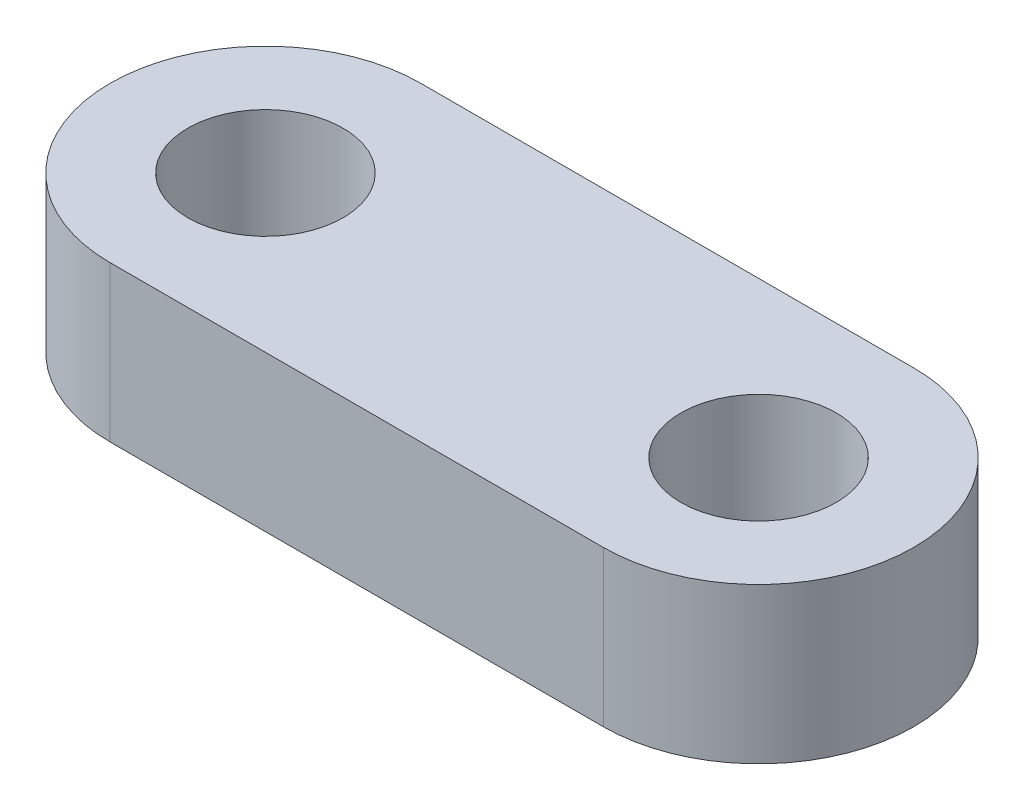
ISO-10303-21;
HEADER;
FILE_DESCRIPTION(('STEP AP214'),'2;1');
FILE_NAME('part.step','',(''),(''),'','','');
FILE_SCHEMA(('AUTOMOTIVE_DESIGN { 1 0 10303 214 1 1 1 1 }'));
ENDSEC;
DATA;
#1=APPLICATION_CONTEXT('core data for automotive mechanical design processes');
#2=APPLICATION_PROTOCOL_DEFINITION('international standard','automotive_design',2000,#1);
#3=PRODUCT_CONTEXT('',#1,'mechanical');
#4=PRODUCT('Part','Part','',(#3));
#5=PRODUCT_RELATED_PRODUCT_CATEGORY('part','',(#4));
#6=PRODUCT_DEFINITION_FORMATION('','',#4);
#7=PRODUCT_DEFINITION_CONTEXT('part definition',#1,'design');
#8=PRODUCT_DEFINITION('design','',#6,#7);
#9=PRODUCT_DEFINITION_SHAPE('','',#8);
#10=(LENGTH_UNIT() NAMED_UNIT(*) SI_UNIT(.MILLI.,.METRE.));
#11=(NAMED_UNIT(*) PLANE_ANGLE_UNIT() SI_UNIT($,.RADIAN.));
#12=(NAMED_UNIT(*) SI_UNIT($,.STERADIAN.) SOLID_ANGLE_UNIT());
#13=UNCERTAINTY_MEASURE_WITH_UNIT(LENGTH_MEASURE(1.E-05),#10,'distance_accuracy_value','');
#14=(GEOMETRIC_REPRESENTATION_CONTEXT(3) GLOBAL_UNCERTAINTY_ASSIGNED_CONTEXT((#13)) GLOBAL_UNIT_ASSIGNED_CONTEXT((#10,
#11,#12)) REPRESENTATION_CONTEXT('',''));
#15=CARTESIAN_POINT('',(0.,0.,0.));
#16=DIRECTION('',(0.,0.,1.));
#17=DIRECTION('',(1.,0.,0.));
#18=AXIS2_PLACEMENT_3D('',#15,#16,#17);
#19=CARTESIAN_POINT('',(-3.175,2.,0.));
#20=DIRECTION('',(0.,1.,0.));
#21=DIRECTION('',(0.,0.,1.));
#22=AXIS2_PLACEMENT_3D('',#19,#20,#21);
#23=PLANE('',#22);
#24=CARTESIAN_POINT('',(3.175,2.,0.));
#25=DIRECTION('',(0.,1.,0.));
#26=DIRECTION('',(0.,0.,1.));
#27=AXIS2_PLACEMENT_3D('',#24,#25,#26);
#28=CIRCLE('',#27,1.);
#29=CARTESIAN_POINT('',(3.175,2.,1.));
#30=VERTEX_POINT('',#29);
#31=EDGE_CURVE('E100',#30,#30,#28,.T.);
#32=ORIENTED_EDGE('',*,*,#31,.F.);
#33=EDGE_LOOP('',(#32));
#34=FACE_BOUND('',#33,.T.);
#35=CARTESIAN_POINT('',(-3.175,2.,0.));
#36=DIRECTION('',(0.,1.,0.));
#37=DIRECTION('',(0.,0.,1.));
#38=AXIS2_PLACEMENT_3D('',#35,#36,#37);
#39=CIRCLE('',#38,2.);
#40=CARTESIAN_POINT('',(-3.175,2.,-2.));
#41=VERTEX_POINT('',#40);
#42=CARTESIAN_POINT('',(-3.175,2.,2.));
#43=VERTEX_POINT('',#42);
#44=EDGE_CURVE('E85',#41,#43,#39,.T.);
#45=ORIENTED_EDGE('',*,*,#44,.T.);
#46=DIRECTION('',(1.,0.,0.));
#47=VECTOR('',#46,1.);
#48=CARTESIAN_POINT('',(-3.175,2.,2.));
#49=LINE('',#48,#47);
#50=CARTESIAN_POINT('',(3.175,2.,2.));
#51=VERTEX_POINT('',#50);
#52=EDGE_CURVE('E80',#43,#51,#49,.T.);
#53=ORIENTED_EDGE('',*,*,#52,.T.);
#54=CARTESIAN_POINT('',(3.175,2.,0.));
#55=DIRECTION('',(0.,1.,0.));
#56=DIRECTION('',(0.,0.,1.));
#57=AXIS2_PLACEMENT_3D('',#54,#55,#56);
#58=CIRCLE('',#57,2.);
#59=CARTESIAN_POINT('',(3.175,2.,-2.));
#60=VERTEX_POINT('',#59);
#61=EDGE_CURVE('E83',#51,#60,#58,.T.);
#62=ORIENTED_EDGE('',*,*,#61,.T.);
#63=DIRECTION('',(-1.,0.,0.));
#64=VECTOR('',#63,1.);
#65=CARTESIAN_POINT('',(-3.175,2.,-2.));
#66=LINE('',#65,#64);
#67=EDGE_CURVE('E50',#60,#41,#66,.T.);
#68=ORIENTED_EDGE('',*,*,#67,.T.);
#69=EDGE_LOOP('',(#45,#53,#62,#68));
#70=FACE_BOUND('',#69,.T.);
#71=CARTESIAN_POINT('',(-3.175,2.,0.));
#72=DIRECTION('',(0.,1.,0.));
#73=DIRECTION('',(0.,0.,1.));
#74=AXIS2_PLACEMENT_3D('',#71,#72,#73);
#75=CIRCLE('',#74,1.);
#76=CARTESIAN_POINT('',(-3.175,2.,1.));
#77=VERTEX_POINT('',#76);
#78=EDGE_CURVE('E115',#77,#77,#75,.T.);
#79=ORIENTED_EDGE('',*,*,#78,.F.);
#80=EDGE_LOOP('',(#79));
#81=FACE_BOUND('',#80,.T.);
#82=ADVANCED_FACE('F33',(#34,#70,#81),#23,.T.);
#83=CARTESIAN_POINT('',(-3.175,0.,0.));
#84=DIRECTION('',(0.,1.,0.));
#85=DIRECTION('',(0.,0.,1.));
#86=AXIS2_PLACEMENT_3D('',#83,#84,#85);
#87=PLANE('',#86);
#88=CARTESIAN_POINT('',(-3.175,0.,0.));
#89=DIRECTION('',(0.,1.,0.));
#90=DIRECTION('',(0.,0.,1.));
#91=AXIS2_PLACEMENT_3D('',#88,#89,#90);
#92=CIRCLE('',#91,2.);
#93=CARTESIAN_POINT('',(-3.175,0.,-2.));
#94=VERTEX_POINT('',#93);
#95=CARTESIAN_POINT('',(-3.175,0.,2.));
#96=VERTEX_POINT('',#95);
#97=EDGE_CURVE('E97',#94,#96,#92,.T.);
#98=ORIENTED_EDGE('',*,*,#97,.F.);
#99=DIRECTION('',(-1.,0.,0.));
#100=VECTOR('',#99,1.);
#101=CARTESIAN_POINT('',(-3.175,0.,-2.));
#102=LINE('',#101,#100);
#103=CARTESIAN_POINT('',(3.175,0.,-2.));
#104=VERTEX_POINT('',#103);
#105=EDGE_CURVE('E73',#104,#94,#102,.T.);
#106=ORIENTED_EDGE('',*,*,#105,.F.);
#107=CARTESIAN_POINT('',(3.175,0.,0.));
#108=DIRECTION('',(0.,1.,0.));
#109=DIRECTION('',(0.,0.,1.));
#110=AXIS2_PLACEMENT_3D('',#107,#108,#109);
#111=CIRCLE('',#110,2.);
#112=CARTESIAN_POINT('',(3.175,0.,2.));
#113=VERTEX_POINT('',#112);
#114=EDGE_CURVE('E67',#113,#104,#111,.T.);
#115=ORIENTED_EDGE('',*,*,#114,.F.);
#116=DIRECTION('',(1.,0.,0.));
#117=VECTOR('',#116,1.);
#118=CARTESIAN_POINT('',(-3.175,0.,2.));
#119=LINE('',#118,#117);
#120=EDGE_CURVE('E89',#96,#113,#119,.T.);
#121=ORIENTED_EDGE('',*,*,#120,.F.);
#122=EDGE_LOOP('',(#98,#106,#115,#121));
#123=FACE_BOUND('',#122,.T.);
#124=CARTESIAN_POINT('',(3.175,0.,0.));
#125=DIRECTION('',(0.,1.,0.));
#126=DIRECTION('',(0.,0.,1.));
#127=AXIS2_PLACEMENT_3D('',#124,#125,#126);
#128=CIRCLE('',#127,1.);
#129=CARTESIAN_POINT('',(3.175,0.,1.));
#130=VERTEX_POINT('',#129);
#131=EDGE_CURVE('E112',#130,#130,#128,.T.);
#132=ORIENTED_EDGE('',*,*,#131,.T.);
#133=EDGE_LOOP('',(#132));
#134=FACE_BOUND('',#133,.T.);
#135=CARTESIAN_POINT('',(-3.175,0.,0.));
#136=DIRECTION('',(0.,1.,0.));
#137=DIRECTION('',(0.,0.,1.));
#138=AXIS2_PLACEMENT_3D('',#135,#136,#137);
#139=CIRCLE('',#138,1.);
#140=CARTESIAN_POINT('',(-3.175,0.,1.));
#141=VERTEX_POINT('',#140);
#142=EDGE_CURVE('E118',#141,#141,#139,.T.);
#143=ORIENTED_EDGE('',*,*,#142,.T.);
#144=EDGE_LOOP('',(#143));
#145=FACE_BOUND('',#144,.T.);
#146=ADVANCED_FACE('F108',(#123,#134,#145),#87,.F.);
#147=CARTESIAN_POINT('',(-3.175,2.,0.));
#148=DIRECTION('',(0.,-1.,0.));
#149=DIRECTION('',(0.,0.,-1.));
#150=AXIS2_PLACEMENT_3D('',#147,#148,#149);
#151=CYLINDRICAL_SURFACE('',#150,2.);
#152=ORIENTED_EDGE('',*,*,#97,.T.);
#153=DIRECTION('',(0.,-1.,0.));
#154=VECTOR('',#153,1.);
#155=CARTESIAN_POINT('',(-3.175,2.,2.));
#156=LINE('',#155,#154);
#157=EDGE_CURVE('E11',#43,#96,#156,.T.);
#158=ORIENTED_EDGE('',*,*,#157,.F.);
#159=ORIENTED_EDGE('',*,*,#44,.F.);
#160=DIRECTION('',(0.,-1.,0.));
#161=VECTOR('',#160,1.);
#162=CARTESIAN_POINT('',(-3.175,2.,-2.));
#163=LINE('',#162,#161);
#164=EDGE_CURVE('E93',#41,#94,#163,.T.);
#165=ORIENTED_EDGE('',*,*,#164,.T.);
#166=EDGE_LOOP('',(#152,#158,#159,#165));
#167=FACE_BOUND('',#166,.T.);
#168=ADVANCED_FACE('F35',(#167),#151,.T.);
#169=CARTESIAN_POINT('',(-3.175,2.,2.));
#170=DIRECTION('',(0.,0.,-1.));
#171=DIRECTION('',(-1.,0.,0.));
#172=AXIS2_PLACEMENT_3D('',#169,#170,#171);
#173=PLANE('',#172);
#174=ORIENTED_EDGE('',*,*,#120,.T.);
#175=DIRECTION('',(0.,-1.,0.));
#176=VECTOR('',#175,1.);
#177=CARTESIAN_POINT('',(3.175,2.,2.));
#178=LINE('',#177,#176);
#179=EDGE_CURVE('E42',#51,#113,#178,.T.);
#180=ORIENTED_EDGE('',*,*,#179,.F.);
#181=ORIENTED_EDGE('',*,*,#52,.F.);
#182=ORIENTED_EDGE('',*,*,#157,.T.);
#183=EDGE_LOOP('',(#174,#180,#181,#182));
#184=FACE_BOUND('',#183,.T.);
#185=ADVANCED_FACE('F88',(#184),#173,.F.);
#186=CARTESIAN_POINT('',(3.175,2.,0.));
#187=DIRECTION('',(0.,-1.,0.));
#188=DIRECTION('',(0.,0.,-1.));
#189=AXIS2_PLACEMENT_3D('',#186,#187,#188);
#190=CYLINDRICAL_SURFACE('',#189,2.);
#191=ORIENTED_EDGE('',*,*,#114,.T.);
#192=DIRECTION('',(0.,-1.,0.));
#193=VECTOR('',#192,1.);
#194=CARTESIAN_POINT('',(3.175,2.,-2.));
#195=LINE('',#194,#193);
#196=EDGE_CURVE('E90',#60,#104,#195,.T.);
#197=ORIENTED_EDGE('',*,*,#196,.F.);
#198=ORIENTED_EDGE('',*,*,#61,.F.);
#199=ORIENTED_EDGE('',*,*,#179,.T.);
#200=EDGE_LOOP('',(#191,#197,#198,#199));
#201=FACE_BOUND('',#200,.T.);
#202=ADVANCED_FACE('F91',(#201),#190,.T.);
#203=CARTESIAN_POINT('',(-3.175,2.,-2.));
#204=DIRECTION('',(0.,0.,1.));
#205=DIRECTION('',(1.,0.,0.));
#206=AXIS2_PLACEMENT_3D('',#203,#204,#205);
#207=PLANE('',#206);
#208=ORIENTED_EDGE('',*,*,#105,.T.);
#209=ORIENTED_EDGE('',*,*,#164,.F.);
#210=ORIENTED_EDGE('',*,*,#67,.F.);
#211=ORIENTED_EDGE('',*,*,#196,.T.);
#212=EDGE_LOOP('',(#208,#209,#210,#211));
#213=FACE_BOUND('',#212,.T.);
#214=ADVANCED_FACE('F105',(#213),#207,.F.);
#215=CARTESIAN_POINT('',(3.175,2.,0.));
#216=DIRECTION('',(0.,-1.,0.));
#217=DIRECTION('',(0.,0.,-1.));
#218=AXIS2_PLACEMENT_3D('',#215,#216,#217);
#219=CYLINDRICAL_SURFACE('',#218,1.);
#220=ORIENTED_EDGE('',*,*,#31,.T.);
#221=EDGE_LOOP('',(#220));
#222=FACE_BOUND('',#221,.T.);
#223=ORIENTED_EDGE('',*,*,#131,.F.);
#224=EDGE_LOOP('',(#223));
#225=FACE_BOUND('',#224,.T.);
#226=ADVANCED_FACE('F135',(#222,#225),#219,.F.);
#227=CARTESIAN_POINT('',(-3.175,2.,0.));
#228=DIRECTION('',(0.,-1.,0.));
#229=DIRECTION('',(0.,0.,-1.));
#230=AXIS2_PLACEMENT_3D('',#227,#228,#229);
#231=CYLINDRICAL_SURFACE('',#230,1.);
#232=ORIENTED_EDGE('',*,*,#78,.T.);
#233=EDGE_LOOP('',(#232));
#234=FACE_BOUND('',#233,.T.);
#235=ORIENTED_EDGE('',*,*,#142,.F.);
#236=EDGE_LOOP('',(#235));
#237=FACE_BOUND('',#236,.T.);
#238=ADVANCED_FACE('F124',(#234,#237),#231,.F.);
#239=CLOSED_SHELL('',(#82,#146,#168,#185,#202,#214,#226,#238));
#240=MANIFOLD_SOLID_BREP('B2',#239);
#241=ADVANCED_BREP_SHAPE_REPRESENTATION('',(#18,#240),#14);
#242=SHAPE_DEFINITION_REPRESENTATION(#9,#241);
ENDSEC;
END-ISO-10303-21;
